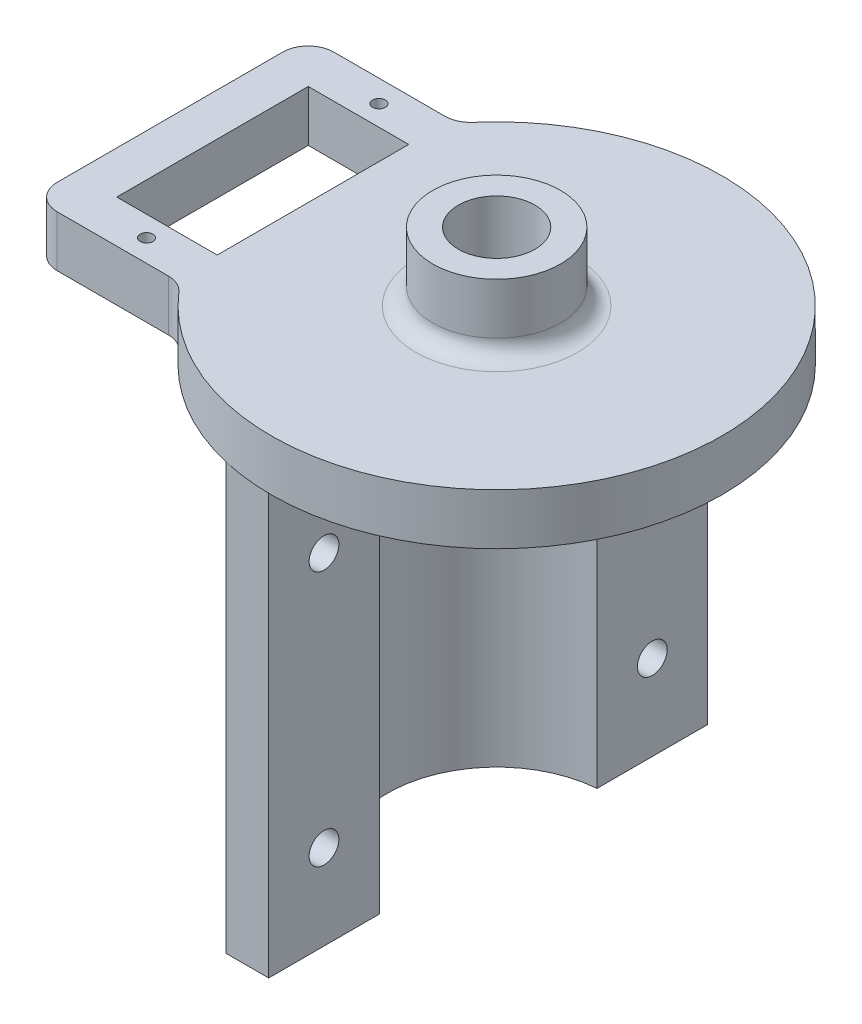
ISO-10303-21;
HEADER;
FILE_DESCRIPTION(('STEP AP214'),'2;1');
FILE_NAME('part.step','',(''),(''),'','','');
FILE_SCHEMA(('AUTOMOTIVE_DESIGN { 1 0 10303 214 1 1 1 1 }'));
ENDSEC;
DATA;
#1=APPLICATION_CONTEXT('core data for automotive mechanical design processes');
#2=APPLICATION_PROTOCOL_DEFINITION('international standard','automotive_design',2000,#1);
#3=PRODUCT_CONTEXT('',#1,'mechanical');
#4=PRODUCT('Part','Part','',(#3));
#5=PRODUCT_RELATED_PRODUCT_CATEGORY('part','',(#4));
#6=PRODUCT_DEFINITION_FORMATION('','',#4);
#7=PRODUCT_DEFINITION_CONTEXT('part definition',#1,'design');
#8=PRODUCT_DEFINITION('design','',#6,#7);
#9=PRODUCT_DEFINITION_SHAPE('','',#8);
#10=(LENGTH_UNIT() NAMED_UNIT(*) SI_UNIT(.MILLI.,.METRE.));
#11=(NAMED_UNIT(*) PLANE_ANGLE_UNIT() SI_UNIT($,.RADIAN.));
#12=(NAMED_UNIT(*) SI_UNIT($,.STERADIAN.) SOLID_ANGLE_UNIT());
#13=UNCERTAINTY_MEASURE_WITH_UNIT(LENGTH_MEASURE(1.E-05),#10,'distance_accuracy_value','');
#14=(GEOMETRIC_REPRESENTATION_CONTEXT(3) GLOBAL_UNCERTAINTY_ASSIGNED_CONTEXT((#13)) GLOBAL_UNIT_ASSIGNED_CONTEXT((#10,
#11,#12)) REPRESENTATION_CONTEXT('',''));
#15=CARTESIAN_POINT('',(0.,0.,0.));
#16=DIRECTION('',(0.,0.,1.));
#17=DIRECTION('',(1.,0.,0.));
#18=AXIS2_PLACEMENT_3D('',#15,#16,#17);
#19=CARTESIAN_POINT('',(-1.,-50.,25.7848331835619));
#20=DIRECTION('',(0.,0.,-1.));
#21=DIRECTION('',(-1.,0.,0.));
#22=AXIS2_PLACEMENT_3D('',#19,#20,#21);
#23=PLANE('',#22);
#24=DIRECTION('',(-1.,0.,0.));
#25=VECTOR('',#24,1.);
#26=CARTESIAN_POINT('',(-1.,0.,25.7848331835619));
#27=LINE('',#26,#25);
#28=CARTESIAN_POINT('',(-1.,0.,25.7848331835619));
#29=VERTEX_POINT('',#28);
#30=CARTESIAN_POINT('',(-6.,0.,25.7848331835619));
#31=VERTEX_POINT('',#30);
#32=EDGE_CURVE('E353',#29,#31,#27,.T.);
#33=ORIENTED_EDGE('',*,*,#32,.T.);
#34=DIRECTION('',(0.,1.,0.));
#35=VECTOR('',#34,1.);
#36=CARTESIAN_POINT('',(-6.,-50.,25.7848331835619));
#37=LINE('',#36,#35);
#38=CARTESIAN_POINT('',(-6.,-50.,25.7848331835619));
#39=VERTEX_POINT('',#38);
#40=EDGE_CURVE('E436',#39,#31,#37,.T.);
#41=ORIENTED_EDGE('',*,*,#40,.F.);
#42=DIRECTION('',(-1.,0.,0.));
#43=VECTOR('',#42,1.);
#44=CARTESIAN_POINT('',(-1.,-50.,25.7848331835619));
#45=LINE('',#44,#43);
#46=CARTESIAN_POINT('',(-1.,-50.,25.7848331835619));
#47=VERTEX_POINT('',#46);
#48=EDGE_CURVE('E354',#47,#39,#45,.T.);
#49=ORIENTED_EDGE('',*,*,#48,.F.);
#50=DIRECTION('',(0.,1.,0.));
#51=VECTOR('',#50,1.);
#52=CARTESIAN_POINT('',(-1.,-50.,25.7848331835619));
#53=LINE('',#52,#51);
#54=EDGE_CURVE('E378',#47,#29,#53,.T.);
#55=ORIENTED_EDGE('',*,*,#54,.T.);
#56=EDGE_LOOP('',(#33,#41,#49,#55));
#57=FACE_BOUND('',#56,.T.);
#58=ADVANCED_FACE('F45',(#57),#23,.F.);
#59=CARTESIAN_POINT('',(-6.,-50.,25.7848331835619));
#60=DIRECTION('',(1.,0.,0.));
#61=DIRECTION('',(0.,0.,-1.));
#62=AXIS2_PLACEMENT_3D('',#59,#60,#61);
#63=PLANE('',#62);
#64=CARTESIAN_POINT('',(-6.,-40.,19.2853936956035));
#65=DIRECTION('',(1.,0.,0.));
#66=DIRECTION('',(0.,0.,-1.));
#67=AXIS2_PLACEMENT_3D('',#64,#65,#66);
#68=CIRCLE('',#67,1.75);
#69=CARTESIAN_POINT('',(-6.,-40.,17.5353936956035));
#70=VERTEX_POINT('',#69);
#71=EDGE_CURVE('E341',#70,#70,#68,.T.);
#72=ORIENTED_EDGE('',*,*,#71,.T.);
#73=EDGE_LOOP('',(#72));
#74=FACE_BOUND('',#73,.T.);
#75=CARTESIAN_POINT('',(-6.,-10.,19.2853936956035));
#76=DIRECTION('',(1.,0.,0.));
#77=DIRECTION('',(0.,0.,-1.));
#78=AXIS2_PLACEMENT_3D('',#75,#76,#77);
#79=CIRCLE('',#78,1.75);
#80=CARTESIAN_POINT('',(-6.,-10.,17.5353936956035));
#81=VERTEX_POINT('',#80);
#82=EDGE_CURVE('E337',#81,#81,#79,.T.);
#83=ORIENTED_EDGE('',*,*,#82,.T.);
#84=EDGE_LOOP('',(#83));
#85=FACE_BOUND('',#84,.T.);
#86=DIRECTION('',(0.,0.,-1.));
#87=VECTOR('',#86,1.);
#88=CARTESIAN_POINT('',(-6.,0.,25.7848331835619));
#89=LINE('',#88,#87);
#90=CARTESIAN_POINT('',(-5.99999999999999,0.,16.7848331835619));
#91=VERTEX_POINT('',#90);
#92=EDGE_CURVE('E382',#31,#91,#89,.T.);
#93=ORIENTED_EDGE('',*,*,#92,.T.);
#94=DIRECTION('',(0.,1.,0.));
#95=VECTOR('',#94,1.);
#96=CARTESIAN_POINT('',(-5.99999999999999,-50.,16.7848331835619));
#97=LINE('',#96,#95);
#98=CARTESIAN_POINT('',(-5.99999999999999,-50.,16.7848331835619));
#99=VERTEX_POINT('',#98);
#100=EDGE_CURVE('E432',#99,#91,#97,.T.);
#101=ORIENTED_EDGE('',*,*,#100,.F.);
#102=DIRECTION('',(0.,0.,-1.));
#103=VECTOR('',#102,1.);
#104=CARTESIAN_POINT('',(-6.,-50.,25.7848331835619));
#105=LINE('',#104,#103);
#106=EDGE_CURVE('E357',#39,#99,#105,.T.);
#107=ORIENTED_EDGE('',*,*,#106,.F.);
#108=ORIENTED_EDGE('',*,*,#40,.T.);
#109=EDGE_LOOP('',(#93,#101,#107,#108));
#110=FACE_BOUND('',#109,.T.);
#111=ADVANCED_FACE('F462',(#74,#85,#110),#63,.F.);
#112=CARTESIAN_POINT('',(0.,-50.,0.));
#113=DIRECTION('',(0.,1.,0.));
#114=DIRECTION('',(0.,0.,1.));
#115=AXIS2_PLACEMENT_3D('',#112,#113,#114);
#116=CYLINDRICAL_SURFACE('',#115,17.825);
#117=CARTESIAN_POINT('',(0.,0.,0.));
#118=DIRECTION('',(0.,-1.,0.));
#119=DIRECTION('',(0.,0.,-1.));
#120=AXIS2_PLACEMENT_3D('',#117,#118,#119);
#121=CIRCLE('',#120,17.825);
#122=CARTESIAN_POINT('',(-6.,0.,-16.7848331835619));
#123=VERTEX_POINT('',#122);
#124=EDGE_CURVE('E386',#91,#123,#121,.T.);
#125=ORIENTED_EDGE('',*,*,#124,.T.);
#126=DIRECTION('',(0.,1.,0.));
#127=VECTOR('',#126,1.);
#128=CARTESIAN_POINT('',(-6.,-50.,-16.7848331835619));
#129=LINE('',#128,#127);
#130=CARTESIAN_POINT('',(-6.,-50.,-16.7848331835619));
#131=VERTEX_POINT('',#130);
#132=EDGE_CURVE('E428',#131,#123,#129,.T.);
#133=ORIENTED_EDGE('',*,*,#132,.F.);
#134=CARTESIAN_POINT('',(0.,-50.,0.));
#135=DIRECTION('',(0.,-1.,0.));
#136=DIRECTION('',(0.,0.,-1.));
#137=AXIS2_PLACEMENT_3D('',#134,#135,#136);
#138=CIRCLE('',#137,17.825);
#139=EDGE_CURVE('E361',#99,#131,#138,.T.);
#140=ORIENTED_EDGE('',*,*,#139,.F.);
#141=ORIENTED_EDGE('',*,*,#100,.T.);
#142=EDGE_LOOP('',(#125,#133,#140,#141));
#143=FACE_BOUND('',#142,.T.);
#144=ADVANCED_FACE('F468',(#143),#116,.T.);
#145=CARTESIAN_POINT('',(-6.,-50.,-16.7848331835619));
#146=DIRECTION('',(1.,0.,0.));
#147=DIRECTION('',(0.,0.,-1.));
#148=AXIS2_PLACEMENT_3D('',#145,#146,#147);
#149=PLANE('',#148);
#150=CARTESIAN_POINT('',(-6.,-10.,-19.2853936956035));
#151=DIRECTION('',(1.,0.,0.));
#152=DIRECTION('',(0.,0.,-1.));
#153=AXIS2_PLACEMENT_3D('',#150,#151,#152);
#154=CIRCLE('',#153,1.75000000000001);
#155=CARTESIAN_POINT('',(-6.,-10.,-21.0353936956035));
#156=VERTEX_POINT('',#155);
#157=EDGE_CURVE('E349',#156,#156,#154,.T.);
#158=ORIENTED_EDGE('',*,*,#157,.T.);
#159=EDGE_LOOP('',(#158));
#160=FACE_BOUND('',#159,.T.);
#161=CARTESIAN_POINT('',(-6.,-40.,-19.2853936956035));
#162=DIRECTION('',(1.,0.,0.));
#163=DIRECTION('',(0.,0.,-1.));
#164=AXIS2_PLACEMENT_3D('',#161,#162,#163);
#165=CIRCLE('',#164,1.75000000000001);
#166=CARTESIAN_POINT('',(-6.,-40.,-21.0353936956036));
#167=VERTEX_POINT('',#166);
#168=EDGE_CURVE('E345',#167,#167,#165,.T.);
#169=ORIENTED_EDGE('',*,*,#168,.T.);
#170=EDGE_LOOP('',(#169));
#171=FACE_BOUND('',#170,.T.);
#172=DIRECTION('',(0.,0.,-1.));
#173=VECTOR('',#172,1.);
#174=CARTESIAN_POINT('',(-6.,0.,-16.7848331835619));
#175=LINE('',#174,#173);
#176=CARTESIAN_POINT('',(-6.,0.,-25.7848331835619));
#177=VERTEX_POINT('',#176);
#178=EDGE_CURVE('E390',#123,#177,#175,.T.);
#179=ORIENTED_EDGE('',*,*,#178,.T.);
#180=DIRECTION('',(0.,1.,0.));
#181=VECTOR('',#180,1.);
#182=CARTESIAN_POINT('',(-6.,-50.,-25.7848331835619));
#183=LINE('',#182,#181);
#184=CARTESIAN_POINT('',(-6.,-50.,-25.7848331835619));
#185=VERTEX_POINT('',#184);
#186=EDGE_CURVE('E424',#185,#177,#183,.T.);
#187=ORIENTED_EDGE('',*,*,#186,.F.);
#188=DIRECTION('',(0.,0.,-1.));
#189=VECTOR('',#188,1.);
#190=CARTESIAN_POINT('',(-6.,-50.,-16.7848331835619));
#191=LINE('',#190,#189);
#192=EDGE_CURVE('E364',#131,#185,#191,.T.);
#193=ORIENTED_EDGE('',*,*,#192,.F.);
#194=ORIENTED_EDGE('',*,*,#132,.T.);
#195=EDGE_LOOP('',(#179,#187,#193,#194));
#196=FACE_BOUND('',#195,.T.);
#197=ADVANCED_FACE('F474',(#160,#171,#196),#149,.F.);
#198=CARTESIAN_POINT('',(-6.,-50.,-25.7848331835619));
#199=DIRECTION('',(0.,0.,1.));
#200=DIRECTION('',(1.,0.,0.));
#201=AXIS2_PLACEMENT_3D('',#198,#199,#200);
#202=PLANE('',#201);
#203=DIRECTION('',(1.,0.,0.));
#204=VECTOR('',#203,1.);
#205=CARTESIAN_POINT('',(-6.,0.,-25.7848331835619));
#206=LINE('',#205,#204);
#207=CARTESIAN_POINT('',(-1.,0.,-25.7848331835619));
#208=VERTEX_POINT('',#207);
#209=EDGE_CURVE('E394',#177,#208,#206,.T.);
#210=ORIENTED_EDGE('',*,*,#209,.T.);
#211=DIRECTION('',(0.,1.,0.));
#212=VECTOR('',#211,1.);
#213=CARTESIAN_POINT('',(-1.,-50.,-25.7848331835619));
#214=LINE('',#213,#212);
#215=CARTESIAN_POINT('',(-1.,-50.,-25.7848331835619));
#216=VERTEX_POINT('',#215);
#217=EDGE_CURVE('E420',#216,#208,#214,.T.);
#218=ORIENTED_EDGE('',*,*,#217,.F.);
#219=DIRECTION('',(1.,0.,0.));
#220=VECTOR('',#219,1.);
#221=CARTESIAN_POINT('',(-6.,-50.,-25.7848331835619));
#222=LINE('',#221,#220);
#223=EDGE_CURVE('E367',#185,#216,#222,.T.);
#224=ORIENTED_EDGE('',*,*,#223,.F.);
#225=ORIENTED_EDGE('',*,*,#186,.T.);
#226=EDGE_LOOP('',(#210,#218,#224,#225));
#227=FACE_BOUND('',#226,.T.);
#228=ADVANCED_FACE('F478',(#227),#202,.F.);
#229=CARTESIAN_POINT('',(-1.,-50.,-25.7848331835619));
#230=DIRECTION('',(-1.,0.,0.));
#231=DIRECTION('',(0.,0.,1.));
#232=AXIS2_PLACEMENT_3D('',#229,#230,#231);
#233=PLANE('',#232);
#234=CARTESIAN_POINT('',(-1.,-10.,-19.2853936956035));
#235=DIRECTION('',(1.,0.,0.));
#236=DIRECTION('',(0.,0.,1.));
#237=AXIS2_PLACEMENT_3D('',#234,#235,#236);
#238=CIRCLE('',#237,1.75000000000001);
#239=CARTESIAN_POINT('',(-1.,-10.,-17.5353936956035));
#240=VERTEX_POINT('',#239);
#241=EDGE_CURVE('E321',#240,#240,#238,.T.);
#242=ORIENTED_EDGE('',*,*,#241,.F.);
#243=EDGE_LOOP('',(#242));
#244=FACE_BOUND('',#243,.T.);
#245=CARTESIAN_POINT('',(-1.,-40.,-19.2853936956035));
#246=DIRECTION('',(1.,0.,0.));
#247=DIRECTION('',(0.,0.,-1.));
#248=AXIS2_PLACEMENT_3D('',#245,#246,#247);
#249=CIRCLE('',#248,1.75000000000001);
#250=CARTESIAN_POINT('',(-1.,-40.,-21.0353936956036));
#251=VERTEX_POINT('',#250);
#252=EDGE_CURVE('E327',#251,#251,#249,.T.);
#253=ORIENTED_EDGE('',*,*,#252,.F.);
#254=EDGE_LOOP('',(#253));
#255=FACE_BOUND('',#254,.T.);
#256=DIRECTION('',(0.,0.,1.));
#257=VECTOR('',#256,1.);
#258=CARTESIAN_POINT('',(-1.,0.,-25.7848331835619));
#259=LINE('',#258,#257);
#260=CARTESIAN_POINT('',(-1.00000000000001,0.,-12.7859542076452));
#261=VERTEX_POINT('',#260);
#262=EDGE_CURVE('E398',#208,#261,#259,.T.);
#263=ORIENTED_EDGE('',*,*,#262,.T.);
#264=DIRECTION('',(0.,1.,0.));
#265=VECTOR('',#264,1.);
#266=CARTESIAN_POINT('',(-1.00000000000001,-50.,-12.7859542076452));
#267=LINE('',#266,#265);
#268=CARTESIAN_POINT('',(-1.00000000000001,-50.,-12.7859542076452));
#269=VERTEX_POINT('',#268);
#270=EDGE_CURVE('E416',#269,#261,#267,.T.);
#271=ORIENTED_EDGE('',*,*,#270,.F.);
#272=DIRECTION('',(0.,0.,1.));
#273=VECTOR('',#272,1.);
#274=CARTESIAN_POINT('',(-1.,-50.,-25.7848331835619));
#275=LINE('',#274,#273);
#276=EDGE_CURVE('E370',#216,#269,#275,.T.);
#277=ORIENTED_EDGE('',*,*,#276,.F.);
#278=ORIENTED_EDGE('',*,*,#217,.T.);
#279=EDGE_LOOP('',(#263,#271,#277,#278));
#280=FACE_BOUND('',#279,.T.);
#281=ADVANCED_FACE('F482',(#244,#255,#280),#233,.F.);
#282=CARTESIAN_POINT('',(0.,-50.,0.));
#283=DIRECTION('',(0.,1.,0.));
#284=DIRECTION('',(0.,0.,1.));
#285=AXIS2_PLACEMENT_3D('',#282,#283,#284);
#286=CYLINDRICAL_SURFACE('',#285,12.825);
#287=CARTESIAN_POINT('',(0.,0.,0.));
#288=DIRECTION('',(0.,1.,0.));
#289=DIRECTION('',(0.,0.,-1.));
#290=AXIS2_PLACEMENT_3D('',#287,#288,#289);
#291=CIRCLE('',#290,12.825);
#292=CARTESIAN_POINT('',(-1.,0.,12.7859542076452));
#293=VERTEX_POINT('',#292);
#294=EDGE_CURVE('E402',#261,#293,#291,.T.);
#295=ORIENTED_EDGE('',*,*,#294,.T.);
#296=DIRECTION('',(0.,1.,0.));
#297=VECTOR('',#296,1.);
#298=CARTESIAN_POINT('',(-1.,-50.,12.7859542076452));
#299=LINE('',#298,#297);
#300=CARTESIAN_POINT('',(-1.,-50.,12.7859542076452));
#301=VERTEX_POINT('',#300);
#302=EDGE_CURVE('E412',#301,#293,#299,.T.);
#303=ORIENTED_EDGE('',*,*,#302,.F.);
#304=CARTESIAN_POINT('',(0.,-50.,0.));
#305=DIRECTION('',(0.,1.,0.));
#306=DIRECTION('',(0.,0.,-1.));
#307=AXIS2_PLACEMENT_3D('',#304,#305,#306);
#308=CIRCLE('',#307,12.825);
#309=EDGE_CURVE('E373',#269,#301,#308,.T.);
#310=ORIENTED_EDGE('',*,*,#309,.F.);
#311=ORIENTED_EDGE('',*,*,#270,.T.);
#312=EDGE_LOOP('',(#295,#303,#310,#311));
#313=FACE_BOUND('',#312,.T.);
#314=ADVANCED_FACE('F486',(#313),#286,.F.);
#315=CARTESIAN_POINT('',(-1.,-50.,25.7848331835619));
#316=DIRECTION('',(-1.,0.,0.));
#317=DIRECTION('',(0.,0.,1.));
#318=AXIS2_PLACEMENT_3D('',#315,#316,#317);
#319=PLANE('',#318);
#320=CARTESIAN_POINT('',(-1.,-40.,19.2853936956035));
#321=DIRECTION('',(1.,0.,0.));
#322=DIRECTION('',(0.,0.,1.));
#323=AXIS2_PLACEMENT_3D('',#320,#321,#322);
#324=CIRCLE('',#323,1.75);
#325=CARTESIAN_POINT('',(-1.,-40.,21.0353936956035));
#326=VERTEX_POINT('',#325);
#327=EDGE_CURVE('E322',#326,#326,#324,.T.);
#328=ORIENTED_EDGE('',*,*,#327,.F.);
#329=EDGE_LOOP('',(#328));
#330=FACE_BOUND('',#329,.T.);
#331=CARTESIAN_POINT('',(-1.,-10.,19.2853936956035));
#332=DIRECTION('',(1.,0.,0.));
#333=DIRECTION('',(0.,0.,-1.));
#334=AXIS2_PLACEMENT_3D('',#331,#332,#333);
#335=CIRCLE('',#334,1.75);
#336=CARTESIAN_POINT('',(-1.,-10.,17.5353936956035));
#337=VERTEX_POINT('',#336);
#338=EDGE_CURVE('E326',#337,#337,#335,.T.);
#339=ORIENTED_EDGE('',*,*,#338,.F.);
#340=EDGE_LOOP('',(#339));
#341=FACE_BOUND('',#340,.T.);
#342=DIRECTION('',(0.,0.,1.));
#343=VECTOR('',#342,1.);
#344=CARTESIAN_POINT('',(-1.,0.,25.7848331835619));
#345=LINE('',#344,#343);
#346=EDGE_CURVE('E358',#293,#29,#345,.T.);
#347=ORIENTED_EDGE('',*,*,#346,.T.);
#348=ORIENTED_EDGE('',*,*,#54,.F.);
#349=DIRECTION('',(0.,0.,1.));
#350=VECTOR('',#349,1.);
#351=CARTESIAN_POINT('',(-1.,-50.,25.7848331835619));
#352=LINE('',#351,#350);
#353=EDGE_CURVE('E62',#301,#47,#352,.T.);
#354=ORIENTED_EDGE('',*,*,#353,.F.);
#355=ORIENTED_EDGE('',*,*,#302,.T.);
#356=EDGE_LOOP('',(#347,#348,#354,#355));
#357=FACE_BOUND('',#356,.T.);
#358=ADVANCED_FACE('F490',(#330,#341,#357),#319,.F.);
#359=CARTESIAN_POINT('',(0.,-50.,0.));
#360=DIRECTION('',(0.,-1.,0.));
#361=DIRECTION('',(0.,0.,-1.));
#362=AXIS2_PLACEMENT_3D('',#359,#360,#361);
#363=PLANE('',#362);
#364=ORIENTED_EDGE('',*,*,#48,.T.);
#365=ORIENTED_EDGE('',*,*,#106,.T.);
#366=ORIENTED_EDGE('',*,*,#139,.T.);
#367=ORIENTED_EDGE('',*,*,#192,.T.);
#368=ORIENTED_EDGE('',*,*,#223,.T.);
#369=ORIENTED_EDGE('',*,*,#276,.T.);
#370=ORIENTED_EDGE('',*,*,#309,.T.);
#371=ORIENTED_EDGE('',*,*,#353,.T.);
#372=EDGE_LOOP('',(#364,#365,#366,#367,#368,#369,#370,#371));
#373=FACE_BOUND('',#372,.T.);
#374=ADVANCED_FACE('F494',(#373),#363,.T.);
#375=CARTESIAN_POINT('',(-17.825,-10.,19.2853936956035));
#376=DIRECTION('',(1.,0.,0.));
#377=DIRECTION('',(0.,0.,-1.));
#378=AXIS2_PLACEMENT_3D('',#375,#376,#377);
#379=CYLINDRICAL_SURFACE('',#378,1.75);
#380=ORIENTED_EDGE('',*,*,#338,.T.);
#381=EDGE_LOOP('',(#380));
#382=FACE_BOUND('',#381,.T.);
#383=ORIENTED_EDGE('',*,*,#82,.F.);
#384=EDGE_LOOP('',(#383));
#385=FACE_BOUND('',#384,.T.);
#386=ADVANCED_FACE('F498',(#382,#385),#379,.F.);
#387=CARTESIAN_POINT('',(-17.825,-40.,19.2853936956035));
#388=DIRECTION('',(1.,0.,0.));
#389=DIRECTION('',(0.,0.,-1.));
#390=AXIS2_PLACEMENT_3D('',#387,#388,#389);
#391=CYLINDRICAL_SURFACE('',#390,1.75);
#392=ORIENTED_EDGE('',*,*,#327,.T.);
#393=EDGE_LOOP('',(#392));
#394=FACE_BOUND('',#393,.T.);
#395=ORIENTED_EDGE('',*,*,#71,.F.);
#396=EDGE_LOOP('',(#395));
#397=FACE_BOUND('',#396,.T.);
#398=ADVANCED_FACE('F501',(#394,#397),#391,.F.);
#399=CARTESIAN_POINT('',(-17.825,-40.,-19.2853936956035));
#400=DIRECTION('',(1.,0.,0.));
#401=DIRECTION('',(0.,0.,-1.));
#402=AXIS2_PLACEMENT_3D('',#399,#400,#401);
#403=CYLINDRICAL_SURFACE('',#402,1.75000000000001);
#404=ORIENTED_EDGE('',*,*,#252,.T.);
#405=EDGE_LOOP('',(#404));
#406=FACE_BOUND('',#405,.T.);
#407=ORIENTED_EDGE('',*,*,#168,.F.);
#408=EDGE_LOOP('',(#407));
#409=FACE_BOUND('',#408,.T.);
#410=ADVANCED_FACE('F506',(#406,#409),#403,.F.);
#411=CARTESIAN_POINT('',(-17.825,-10.,-19.2853936956035));
#412=DIRECTION('',(1.,0.,0.));
#413=DIRECTION('',(0.,0.,-1.));
#414=AXIS2_PLACEMENT_3D('',#411,#412,#413);
#415=CYLINDRICAL_SURFACE('',#414,1.75000000000001);
#416=ORIENTED_EDGE('',*,*,#241,.T.);
#417=EDGE_LOOP('',(#416));
#418=FACE_BOUND('',#417,.T.);
#419=ORIENTED_EDGE('',*,*,#157,.F.);
#420=EDGE_LOOP('',(#419));
#421=FACE_BOUND('',#420,.T.);
#422=ADVANCED_FACE('F503',(#418,#421),#415,.F.);
#423=CARTESIAN_POINT('',(-22.3189922807748,0.,-19.25));
#424=DIRECTION('',(0.,1.,0.));
#425=DIRECTION('',(0.,0.,1.));
#426=AXIS2_PLACEMENT_3D('',#423,#424,#425);
#427=PLANE('',#426);
#428=CARTESIAN_POINT('',(0.,0.,0.));
#429=DIRECTION('',(0.,1.,0.));
#430=DIRECTION('',(0.,0.,1.));
#431=AXIS2_PLACEMENT_3D('',#428,#429,#430);
#432=CIRCLE('',#431,4.5);
#433=CARTESIAN_POINT('',(0.,0.,4.5));
#434=VERTEX_POINT('',#433);
#435=EDGE_CURVE('E848',#434,#434,#432,.T.);
#436=ORIENTED_EDGE('',*,*,#435,.T.);
#437=EDGE_LOOP('',(#436));
#438=FACE_BOUND('',#437,.T.);
#439=ORIENTED_EDGE('',*,*,#32,.F.);
#440=ORIENTED_EDGE('',*,*,#346,.F.);
#441=ORIENTED_EDGE('',*,*,#294,.F.);
#442=ORIENTED_EDGE('',*,*,#262,.F.);
#443=ORIENTED_EDGE('',*,*,#209,.F.);
#444=CARTESIAN_POINT('',(0.,0.,0.));
#445=DIRECTION('',(0.,1.,0.));
#446=DIRECTION('',(0.,0.,1.));
#447=AXIS2_PLACEMENT_3D('',#444,#445,#446);
#448=CIRCLE('',#447,26.4737156875289);
#449=EDGE_CURVE('E289',#31,#177,#448,.T.);
#450=ORIENTED_EDGE('',*,*,#449,.F.);
#451=EDGE_LOOP('',(#439,#440,#441,#442,#443,#450));
#452=FACE_BOUND('',#451,.T.);
#453=ADVANCED_FACE('F505',(#438,#452),#427,.F.);
#454=CARTESIAN_POINT('',(-27.4841317854503,0.,13.65));
#455=DIRECTION('',(0.,1.,0.));
#456=DIRECTION('',(0.,0.,1.));
#457=AXIS2_PLACEMENT_3D('',#454,#455,#456);
#458=CIRCLE('',#457,0.749999999999998);
#459=CARTESIAN_POINT('',(-27.4841317854503,0.,14.4));
#460=VERTEX_POINT('',#459);
#461=EDGE_CURVE('E777',#460,#460,#458,.T.);
#462=ORIENTED_EDGE('',*,*,#461,.T.);
#463=EDGE_LOOP('',(#462));
#464=FACE_BOUND('',#463,.T.);
#465=CARTESIAN_POINT('',(-27.4841317854503,0.,-13.65));
#466=DIRECTION('',(0.,1.,0.));
#467=DIRECTION('',(0.,0.,1.));
#468=AXIS2_PLACEMENT_3D('',#465,#466,#467);
#469=CIRCLE('',#468,0.749999999999998);
#470=CARTESIAN_POINT('',(-27.4841317854503,0.,-12.9));
#471=VERTEX_POINT('',#470);
#472=EDGE_CURVE('E781',#471,#471,#469,.T.);
#473=ORIENTED_EDGE('',*,*,#472,.T.);
#474=EDGE_LOOP('',(#473));
#475=FACE_BOUND('',#474,.T.);
#476=DIRECTION('',(0.,0.,1.));
#477=VECTOR('',#476,1.);
#478=CARTESIAN_POINT('',(-33.3841317854503,0.,11.25));
#479=LINE('',#478,#477);
#480=CARTESIAN_POINT('',(-33.3841317854503,0.,-11.25));
#481=VERTEX_POINT('',#480);
#482=CARTESIAN_POINT('',(-33.3841317854503,0.,11.25));
#483=VERTEX_POINT('',#482);
#484=EDGE_CURVE('E217',#481,#483,#479,.T.);
#485=ORIENTED_EDGE('',*,*,#484,.T.);
#486=DIRECTION('',(1.,0.,0.));
#487=VECTOR('',#486,1.);
#488=CARTESIAN_POINT('',(-33.3841317854503,0.,11.25));
#489=LINE('',#488,#487);
#490=CARTESIAN_POINT('',(-21.5841317854503,0.,11.25));
#491=VERTEX_POINT('',#490);
#492=EDGE_CURVE('E198',#483,#491,#489,.T.);
#493=ORIENTED_EDGE('',*,*,#492,.T.);
#494=DIRECTION('',(0.,0.,-1.));
#495=VECTOR('',#494,1.);
#496=CARTESIAN_POINT('',(-21.5841317854503,0.,11.25));
#497=LINE('',#496,#495);
#498=CARTESIAN_POINT('',(-21.5841317854503,0.,-11.25));
#499=VERTEX_POINT('',#498);
#500=EDGE_CURVE('E223',#491,#499,#497,.T.);
#501=ORIENTED_EDGE('',*,*,#500,.T.);
#502=DIRECTION('',(-1.,0.,0.));
#503=VECTOR('',#502,1.);
#504=CARTESIAN_POINT('',(-33.3841317854503,0.,-11.25));
#505=LINE('',#504,#503);
#506=EDGE_CURVE('E192',#499,#481,#505,.T.);
#507=ORIENTED_EDGE('',*,*,#506,.T.);
#508=EDGE_LOOP('',(#485,#493,#501,#507));
#509=FACE_BOUND('',#508,.T.);
#510=ORIENTED_EDGE('',*,*,#178,.F.);
#511=ORIENTED_EDGE('',*,*,#124,.F.);
#512=ORIENTED_EDGE('',*,*,#92,.F.);
#513=CARTESIAN_POINT('',(-20.0472401355014,0.,17.290627092551));
#514=VERTEX_POINT('',#513);
#515=EDGE_CURVE('E242',#514,#31,#448,.T.);
#516=ORIENTED_EDGE('',*,*,#515,.F.);
#517=CARTESIAN_POINT('',(-22.3189922807748,0.,19.25));
#518=DIRECTION('',(0.,-1.,0.));
#519=DIRECTION('',(0.,0.,-1.));
#520=AXIS2_PLACEMENT_3D('',#517,#518,#519);
#521=CIRCLE('',#520,3.);
#522=CARTESIAN_POINT('',(-22.3189922807748,0.,16.25));
#523=VERTEX_POINT('',#522);
#524=EDGE_CURVE('E282',#523,#514,#521,.T.);
#525=ORIENTED_EDGE('',*,*,#524,.F.);
#526=DIRECTION('',(1.,0.,0.));
#527=VECTOR('',#526,1.);
#528=CARTESIAN_POINT('',(-35.3841317854503,0.,16.25));
#529=LINE('',#528,#527);
#530=CARTESIAN_POINT('',(-35.3841317854503,0.,16.25));
#531=VERTEX_POINT('',#530);
#532=EDGE_CURVE('E279',#531,#523,#529,.T.);
#533=ORIENTED_EDGE('',*,*,#532,.F.);
#534=CARTESIAN_POINT('',(-35.3841317854503,0.,13.25));
#535=DIRECTION('',(0.,1.,0.));
#536=DIRECTION('',(0.,0.,-1.));
#537=AXIS2_PLACEMENT_3D('',#534,#535,#536);
#538=CIRCLE('',#537,3.);
#539=CARTESIAN_POINT('',(-38.3841317854503,0.,13.25));
#540=VERTEX_POINT('',#539);
#541=EDGE_CURVE('E276',#540,#531,#538,.T.);
#542=ORIENTED_EDGE('',*,*,#541,.F.);
#543=DIRECTION('',(0.,0.,1.));
#544=VECTOR('',#543,1.);
#545=CARTESIAN_POINT('',(-38.3841317854503,0.,13.25));
#546=LINE('',#545,#544);
#547=CARTESIAN_POINT('',(-38.3841317854503,0.,-13.25));
#548=VERTEX_POINT('',#547);
#549=EDGE_CURVE('E273',#548,#540,#546,.T.);
#550=ORIENTED_EDGE('',*,*,#549,.F.);
#551=CARTESIAN_POINT('',(-35.3841317854503,0.,-13.25));
#552=DIRECTION('',(0.,1.,0.));
#553=DIRECTION('',(0.,0.,-1.));
#554=AXIS2_PLACEMENT_3D('',#551,#552,#553);
#555=CIRCLE('',#554,3.);
#556=CARTESIAN_POINT('',(-35.3841317854503,0.,-16.25));
#557=VERTEX_POINT('',#556);
#558=EDGE_CURVE('E270',#557,#548,#555,.T.);
#559=ORIENTED_EDGE('',*,*,#558,.F.);
#560=DIRECTION('',(-1.,0.,0.));
#561=VECTOR('',#560,1.);
#562=CARTESIAN_POINT('',(-35.3841317854503,0.,-16.25));
#563=LINE('',#562,#561);
#564=CARTESIAN_POINT('',(-22.3189922807748,0.,-16.25));
#565=VERTEX_POINT('',#564);
#566=EDGE_CURVE('E267',#565,#557,#563,.T.);
#567=ORIENTED_EDGE('',*,*,#566,.F.);
#568=CARTESIAN_POINT('',(-22.3189922807748,0.,-19.25));
#569=DIRECTION('',(0.,-1.,0.));
#570=DIRECTION('',(0.,0.,1.));
#571=AXIS2_PLACEMENT_3D('',#568,#569,#570);
#572=CIRCLE('',#571,3.);
#573=CARTESIAN_POINT('',(-20.0472401355014,0.,-17.290627092551));
#574=VERTEX_POINT('',#573);
#575=EDGE_CURVE('E200',#574,#565,#572,.T.);
#576=ORIENTED_EDGE('',*,*,#575,.F.);
#577=EDGE_CURVE('E285',#177,#574,#448,.T.);
#578=ORIENTED_EDGE('',*,*,#577,.F.);
#579=EDGE_LOOP('',(#510,#511,#512,#516,#525,#533,#542,#550,#559,#567,#576,#578));
#580=FACE_BOUND('',#579,.T.);
#581=ADVANCED_FACE('F547',(#464,#475,#509,#580),#427,.F.);
#582=CARTESIAN_POINT('',(-22.3189922807748,6.,-19.25));
#583=DIRECTION('',(0.,1.,0.));
#584=DIRECTION('',(0.,0.,1.));
#585=AXIS2_PLACEMENT_3D('',#582,#583,#584);
#586=PLANE('',#585);
#587=CARTESIAN_POINT('',(0.,6.,0.));
#588=DIRECTION('',(0.,1.,0.));
#589=DIRECTION('',(0.,0.,1.));
#590=AXIS2_PLACEMENT_3D('',#587,#588,#589);
#591=CIRCLE('',#590,9.5);
#592=CARTESIAN_POINT('',(0.,6.,9.5));
#593=VERTEX_POINT('',#592);
#594=EDGE_CURVE('E11',#593,#593,#591,.F.);
#595=ORIENTED_EDGE('',*,*,#594,.T.);
#596=EDGE_LOOP('',(#595));
#597=FACE_BOUND('',#596,.T.);
#598=CARTESIAN_POINT('',(-27.4841317854503,6.,-13.65));
#599=DIRECTION('',(0.,1.,0.));
#600=DIRECTION('',(0.,0.,1.));
#601=AXIS2_PLACEMENT_3D('',#598,#599,#600);
#602=CIRCLE('',#601,0.749999999999998);
#603=CARTESIAN_POINT('',(-27.4841317854503,6.,-12.9));
#604=VERTEX_POINT('',#603);
#605=EDGE_CURVE('E220',#604,#604,#602,.T.);
#606=ORIENTED_EDGE('',*,*,#605,.F.);
#607=EDGE_LOOP('',(#606));
#608=FACE_BOUND('',#607,.T.);
#609=CARTESIAN_POINT('',(-22.3189922807748,6.,-19.25));
#610=DIRECTION('',(0.,-1.,0.));
#611=DIRECTION('',(0.,0.,1.));
#612=AXIS2_PLACEMENT_3D('',#609,#610,#611);
#613=CIRCLE('',#612,3.);
#614=CARTESIAN_POINT('',(-20.0472401355014,6.,-17.290627092551));
#615=VERTEX_POINT('',#614);
#616=CARTESIAN_POINT('',(-22.3189922807748,6.,-16.25));
#617=VERTEX_POINT('',#616);
#618=EDGE_CURVE('E237',#615,#617,#613,.T.);
#619=ORIENTED_EDGE('',*,*,#618,.T.);
#620=DIRECTION('',(-1.,0.,0.));
#621=VECTOR('',#620,1.);
#622=CARTESIAN_POINT('',(-35.3841317854503,6.,-16.25));
#623=LINE('',#622,#621);
#624=CARTESIAN_POINT('',(-35.3841317854503,6.,-16.25));
#625=VERTEX_POINT('',#624);
#626=EDGE_CURVE('E241',#617,#625,#623,.T.);
#627=ORIENTED_EDGE('',*,*,#626,.T.);
#628=CARTESIAN_POINT('',(-35.3841317854503,6.,-13.25));
#629=DIRECTION('',(0.,1.,0.));
#630=DIRECTION('',(0.,0.,-1.));
#631=AXIS2_PLACEMENT_3D('',#628,#629,#630);
#632=CIRCLE('',#631,3.);
#633=CARTESIAN_POINT('',(-38.3841317854503,6.,-13.25));
#634=VERTEX_POINT('',#633);
#635=EDGE_CURVE('E245',#625,#634,#632,.T.);
#636=ORIENTED_EDGE('',*,*,#635,.T.);
#637=DIRECTION('',(0.,0.,1.));
#638=VECTOR('',#637,1.);
#639=CARTESIAN_POINT('',(-38.3841317854503,6.,13.25));
#640=LINE('',#639,#638);
#641=CARTESIAN_POINT('',(-38.3841317854503,6.,13.25));
#642=VERTEX_POINT('',#641);
#643=EDGE_CURVE('E248',#634,#642,#640,.T.);
#644=ORIENTED_EDGE('',*,*,#643,.T.);
#645=CARTESIAN_POINT('',(-35.3841317854503,6.,13.25));
#646=DIRECTION('',(0.,1.,0.));
#647=DIRECTION('',(0.,0.,-1.));
#648=AXIS2_PLACEMENT_3D('',#645,#646,#647);
#649=CIRCLE('',#648,3.);
#650=CARTESIAN_POINT('',(-35.3841317854503,6.,16.25));
#651=VERTEX_POINT('',#650);
#652=EDGE_CURVE('E251',#642,#651,#649,.T.);
#653=ORIENTED_EDGE('',*,*,#652,.T.);
#654=DIRECTION('',(1.,0.,0.));
#655=VECTOR('',#654,1.);
#656=CARTESIAN_POINT('',(-35.3841317854503,6.,16.25));
#657=LINE('',#656,#655);
#658=CARTESIAN_POINT('',(-22.3189922807748,6.,16.25));
#659=VERTEX_POINT('',#658);
#660=EDGE_CURVE('E254',#651,#659,#657,.T.);
#661=ORIENTED_EDGE('',*,*,#660,.T.);
#662=CARTESIAN_POINT('',(-22.3189922807748,6.,19.25));
#663=DIRECTION('',(0.,-1.,0.));
#664=DIRECTION('',(0.,0.,-1.));
#665=AXIS2_PLACEMENT_3D('',#662,#663,#664);
#666=CIRCLE('',#665,3.);
#667=CARTESIAN_POINT('',(-20.0472401355014,6.,17.290627092551));
#668=VERTEX_POINT('',#667);
#669=EDGE_CURVE('E257',#659,#668,#666,.T.);
#670=ORIENTED_EDGE('',*,*,#669,.T.);
#671=CARTESIAN_POINT('',(0.,6.,0.));
#672=DIRECTION('',(0.,1.,0.));
#673=DIRECTION('',(0.,0.,1.));
#674=AXIS2_PLACEMENT_3D('',#671,#672,#673);
#675=CIRCLE('',#674,26.4737156875289);
#676=EDGE_CURVE('E260',#668,#615,#675,.T.);
#677=ORIENTED_EDGE('',*,*,#676,.T.);
#678=EDGE_LOOP('',(#619,#627,#636,#644,#653,#661,#670,#677));
#679=FACE_BOUND('',#678,.T.);
#680=DIRECTION('',(1.,0.,0.));
#681=VECTOR('',#680,1.);
#682=CARTESIAN_POINT('',(-33.3841317854503,6.,11.25));
#683=LINE('',#682,#681);
#684=CARTESIAN_POINT('',(-33.3841317854503,6.,11.25));
#685=VERTEX_POINT('',#684);
#686=CARTESIAN_POINT('',(-21.5841317854503,6.,11.25));
#687=VERTEX_POINT('',#686);
#688=EDGE_CURVE('E191',#685,#687,#683,.T.);
#689=ORIENTED_EDGE('',*,*,#688,.F.);
#690=DIRECTION('',(0.,0.,1.));
#691=VECTOR('',#690,1.);
#692=CARTESIAN_POINT('',(-33.3841317854503,6.,11.25));
#693=LINE('',#692,#691);
#694=CARTESIAN_POINT('',(-33.3841317854503,6.,-11.25));
#695=VERTEX_POINT('',#694);
#696=EDGE_CURVE('E180',#695,#685,#693,.T.);
#697=ORIENTED_EDGE('',*,*,#696,.F.);
#698=DIRECTION('',(-1.,0.,0.));
#699=VECTOR('',#698,1.);
#700=CARTESIAN_POINT('',(-33.3841317854503,6.,-11.25));
#701=LINE('',#700,#699);
#702=CARTESIAN_POINT('',(-21.5841317854503,6.,-11.25));
#703=VERTEX_POINT('',#702);
#704=EDGE_CURVE('E211',#703,#695,#701,.T.);
#705=ORIENTED_EDGE('',*,*,#704,.F.);
#706=DIRECTION('',(0.,0.,-1.));
#707=VECTOR('',#706,1.);
#708=CARTESIAN_POINT('',(-21.5841317854503,6.,11.25));
#709=LINE('',#708,#707);
#710=EDGE_CURVE('E207',#687,#703,#709,.T.);
#711=ORIENTED_EDGE('',*,*,#710,.F.);
#712=EDGE_LOOP('',(#689,#697,#705,#711));
#713=FACE_BOUND('',#712,.T.);
#714=CARTESIAN_POINT('',(-27.4841317854503,6.,13.65));
#715=DIRECTION('',(0.,1.,0.));
#716=DIRECTION('',(0.,0.,1.));
#717=AXIS2_PLACEMENT_3D('',#714,#715,#716);
#718=CIRCLE('',#717,0.749999999999998);
#719=CARTESIAN_POINT('',(-27.4841317854503,6.,14.4));
#720=VERTEX_POINT('',#719);
#721=EDGE_CURVE('E834',#720,#720,#718,.T.);
#722=ORIENTED_EDGE('',*,*,#721,.F.);
#723=EDGE_LOOP('',(#722));
#724=FACE_BOUND('',#723,.T.);
#725=ADVANCED_FACE('F204',(#597,#608,#679,#713,#724),#586,.T.);
#726=CARTESIAN_POINT('',(-22.3189922807748,6.,-19.25));
#727=DIRECTION('',(0.,-1.,0.));
#728=DIRECTION('',(0.,0.,-1.));
#729=AXIS2_PLACEMENT_3D('',#726,#727,#728);
#730=CYLINDRICAL_SURFACE('',#729,3.);
#731=ORIENTED_EDGE('',*,*,#575,.T.);
#732=DIRECTION('',(0.,-1.,0.));
#733=VECTOR('',#732,1.);
#734=CARTESIAN_POINT('',(-22.3189922807748,6.,-16.25));
#735=LINE('',#734,#733);
#736=EDGE_CURVE('E317',#617,#565,#735,.T.);
#737=ORIENTED_EDGE('',*,*,#736,.F.);
#738=ORIENTED_EDGE('',*,*,#618,.F.);
#739=DIRECTION('',(0.,-1.,0.));
#740=VECTOR('',#739,1.);
#741=CARTESIAN_POINT('',(-20.0472401355014,6.,-17.290627092551));
#742=LINE('',#741,#740);
#743=EDGE_CURVE('E263',#615,#574,#742,.T.);
#744=ORIENTED_EDGE('',*,*,#743,.T.);
#745=EDGE_LOOP('',(#731,#737,#738,#744));
#746=FACE_BOUND('',#745,.T.);
#747=ADVANCED_FACE('F514',(#746),#730,.F.);
#748=CARTESIAN_POINT('',(-35.3841317854503,6.,-16.25));
#749=DIRECTION('',(0.,0.,1.));
#750=DIRECTION('',(1.,0.,0.));
#751=AXIS2_PLACEMENT_3D('',#748,#749,#750);
#752=PLANE('',#751);
#753=ORIENTED_EDGE('',*,*,#566,.T.);
#754=DIRECTION('',(0.,-1.,0.));
#755=VECTOR('',#754,1.);
#756=CARTESIAN_POINT('',(-35.3841317854503,6.,-16.25));
#757=LINE('',#756,#755);
#758=EDGE_CURVE('E313',#625,#557,#757,.T.);
#759=ORIENTED_EDGE('',*,*,#758,.F.);
#760=ORIENTED_EDGE('',*,*,#626,.F.);
#761=ORIENTED_EDGE('',*,*,#736,.T.);
#762=EDGE_LOOP('',(#753,#759,#760,#761));
#763=FACE_BOUND('',#762,.T.);
#764=ADVANCED_FACE('F517',(#763),#752,.F.);
#765=CARTESIAN_POINT('',(-35.3841317854503,6.,-13.25));
#766=DIRECTION('',(0.,-1.,0.));
#767=DIRECTION('',(0.,0.,-1.));
#768=AXIS2_PLACEMENT_3D('',#765,#766,#767);
#769=CYLINDRICAL_SURFACE('',#768,3.);
#770=ORIENTED_EDGE('',*,*,#558,.T.);
#771=DIRECTION('',(0.,-1.,0.));
#772=VECTOR('',#771,1.);
#773=CARTESIAN_POINT('',(-38.3841317854503,6.,-13.25));
#774=LINE('',#773,#772);
#775=EDGE_CURVE('E309',#634,#548,#774,.T.);
#776=ORIENTED_EDGE('',*,*,#775,.F.);
#777=ORIENTED_EDGE('',*,*,#635,.F.);
#778=ORIENTED_EDGE('',*,*,#758,.T.);
#779=EDGE_LOOP('',(#770,#776,#777,#778));
#780=FACE_BOUND('',#779,.T.);
#781=ADVANCED_FACE('F521',(#780),#769,.T.);
#782=CARTESIAN_POINT('',(-38.3841317854503,6.,13.25));
#783=DIRECTION('',(1.,0.,0.));
#784=DIRECTION('',(0.,0.,-1.));
#785=AXIS2_PLACEMENT_3D('',#782,#783,#784);
#786=PLANE('',#785);
#787=ORIENTED_EDGE('',*,*,#549,.T.);
#788=DIRECTION('',(0.,-1.,0.));
#789=VECTOR('',#788,1.);
#790=CARTESIAN_POINT('',(-38.3841317854503,6.,13.25));
#791=LINE('',#790,#789);
#792=EDGE_CURVE('E305',#642,#540,#791,.T.);
#793=ORIENTED_EDGE('',*,*,#792,.F.);
#794=ORIENTED_EDGE('',*,*,#643,.F.);
#795=ORIENTED_EDGE('',*,*,#775,.T.);
#796=EDGE_LOOP('',(#787,#793,#794,#795));
#797=FACE_BOUND('',#796,.T.);
#798=ADVANCED_FACE('F525',(#797),#786,.F.);
#799=CARTESIAN_POINT('',(-35.3841317854503,6.,13.25));
#800=DIRECTION('',(0.,-1.,0.));
#801=DIRECTION('',(0.,0.,-1.));
#802=AXIS2_PLACEMENT_3D('',#799,#800,#801);
#803=CYLINDRICAL_SURFACE('',#802,3.);
#804=ORIENTED_EDGE('',*,*,#541,.T.);
#805=DIRECTION('',(0.,-1.,0.));
#806=VECTOR('',#805,1.);
#807=CARTESIAN_POINT('',(-35.3841317854503,6.,16.25));
#808=LINE('',#807,#806);
#809=EDGE_CURVE('E301',#651,#531,#808,.T.);
#810=ORIENTED_EDGE('',*,*,#809,.F.);
#811=ORIENTED_EDGE('',*,*,#652,.F.);
#812=ORIENTED_EDGE('',*,*,#792,.T.);
#813=EDGE_LOOP('',(#804,#810,#811,#812));
#814=FACE_BOUND('',#813,.T.);
#815=ADVANCED_FACE('F529',(#814),#803,.T.);
#816=CARTESIAN_POINT('',(-35.3841317854503,6.,16.25));
#817=DIRECTION('',(0.,0.,-1.));
#818=DIRECTION('',(-1.,0.,0.));
#819=AXIS2_PLACEMENT_3D('',#816,#817,#818);
#820=PLANE('',#819);
#821=ORIENTED_EDGE('',*,*,#532,.T.);
#822=DIRECTION('',(0.,-1.,0.));
#823=VECTOR('',#822,1.);
#824=CARTESIAN_POINT('',(-22.3189922807748,6.,16.25));
#825=LINE('',#824,#823);
#826=EDGE_CURVE('E297',#659,#523,#825,.T.);
#827=ORIENTED_EDGE('',*,*,#826,.F.);
#828=ORIENTED_EDGE('',*,*,#660,.F.);
#829=ORIENTED_EDGE('',*,*,#809,.T.);
#830=EDGE_LOOP('',(#821,#827,#828,#829));
#831=FACE_BOUND('',#830,.T.);
#832=ADVANCED_FACE('F533',(#831),#820,.F.);
#833=CARTESIAN_POINT('',(-22.3189922807748,6.,19.25));
#834=DIRECTION('',(0.,-1.,0.));
#835=DIRECTION('',(0.,0.,-1.));
#836=AXIS2_PLACEMENT_3D('',#833,#834,#835);
#837=CYLINDRICAL_SURFACE('',#836,3.);
#838=ORIENTED_EDGE('',*,*,#524,.T.);
#839=DIRECTION('',(0.,-1.,0.));
#840=VECTOR('',#839,1.);
#841=CARTESIAN_POINT('',(-20.0472401355014,6.,17.290627092551));
#842=LINE('',#841,#840);
#843=EDGE_CURVE('E293',#668,#514,#842,.T.);
#844=ORIENTED_EDGE('',*,*,#843,.F.);
#845=ORIENTED_EDGE('',*,*,#669,.F.);
#846=ORIENTED_EDGE('',*,*,#826,.T.);
#847=EDGE_LOOP('',(#838,#844,#845,#846));
#848=FACE_BOUND('',#847,.T.);
#849=ADVANCED_FACE('F537',(#848),#837,.F.);
#850=CARTESIAN_POINT('',(0.,6.,0.));
#851=DIRECTION('',(0.,-1.,0.));
#852=DIRECTION('',(0.,0.,-1.));
#853=AXIS2_PLACEMENT_3D('',#850,#851,#852);
#854=CYLINDRICAL_SURFACE('',#853,26.4737156875289);
#855=ORIENTED_EDGE('',*,*,#515,.T.);
#856=ORIENTED_EDGE('',*,*,#449,.T.);
#857=ORIENTED_EDGE('',*,*,#577,.T.);
#858=ORIENTED_EDGE('',*,*,#743,.F.);
#859=ORIENTED_EDGE('',*,*,#676,.F.);
#860=ORIENTED_EDGE('',*,*,#843,.T.);
#861=EDGE_LOOP('',(#855,#856,#857,#858,#859,#860));
#862=FACE_BOUND('',#861,.T.);
#863=ADVANCED_FACE('F541',(#862),#854,.T.);
#864=CARTESIAN_POINT('',(-33.3841317854503,6.,11.25));
#865=DIRECTION('',(1.,0.,0.));
#866=DIRECTION('',(0.,0.,-1.));
#867=AXIS2_PLACEMENT_3D('',#864,#865,#866);
#868=PLANE('',#867);
#869=ORIENTED_EDGE('',*,*,#484,.F.);
#870=DIRECTION('',(0.,-1.,0.));
#871=VECTOR('',#870,1.);
#872=CARTESIAN_POINT('',(-33.3841317854503,6.,-11.25));
#873=LINE('',#872,#871);
#874=EDGE_CURVE('E186',#695,#481,#873,.T.);
#875=ORIENTED_EDGE('',*,*,#874,.F.);
#876=ORIENTED_EDGE('',*,*,#696,.T.);
#877=DIRECTION('',(0.,-1.,0.));
#878=VECTOR('',#877,1.);
#879=CARTESIAN_POINT('',(-33.3841317854503,6.,11.25));
#880=LINE('',#879,#878);
#881=EDGE_CURVE('E183',#685,#483,#880,.T.);
#882=ORIENTED_EDGE('',*,*,#881,.T.);
#883=EDGE_LOOP('',(#869,#875,#876,#882));
#884=FACE_BOUND('',#883,.T.);
#885=ADVANCED_FACE('F182',(#884),#868,.T.);
#886=CARTESIAN_POINT('',(-33.3841317854503,6.,11.25));
#887=DIRECTION('',(0.,0.,-1.));
#888=DIRECTION('',(-1.,0.,0.));
#889=AXIS2_PLACEMENT_3D('',#886,#887,#888);
#890=PLANE('',#889);
#891=ORIENTED_EDGE('',*,*,#492,.F.);
#892=ORIENTED_EDGE('',*,*,#881,.F.);
#893=ORIENTED_EDGE('',*,*,#688,.T.);
#894=DIRECTION('',(0.,-1.,0.));
#895=VECTOR('',#894,1.);
#896=CARTESIAN_POINT('',(-21.5841317854503,6.,11.25));
#897=LINE('',#896,#895);
#898=EDGE_CURVE('E201',#687,#491,#897,.T.);
#899=ORIENTED_EDGE('',*,*,#898,.T.);
#900=EDGE_LOOP('',(#891,#892,#893,#899));
#901=FACE_BOUND('',#900,.T.);
#902=ADVANCED_FACE('F195',(#901),#890,.T.);
#903=CARTESIAN_POINT('',(-21.5841317854503,6.,11.25));
#904=DIRECTION('',(-1.,0.,0.));
#905=DIRECTION('',(0.,0.,1.));
#906=AXIS2_PLACEMENT_3D('',#903,#904,#905);
#907=PLANE('',#906);
#908=ORIENTED_EDGE('',*,*,#500,.F.);
#909=ORIENTED_EDGE('',*,*,#898,.F.);
#910=ORIENTED_EDGE('',*,*,#710,.T.);
#911=DIRECTION('',(0.,-1.,0.));
#912=VECTOR('',#911,1.);
#913=CARTESIAN_POINT('',(-21.5841317854503,6.,-11.25));
#914=LINE('',#913,#912);
#915=EDGE_CURVE('E232',#703,#499,#914,.T.);
#916=ORIENTED_EDGE('',*,*,#915,.T.);
#917=EDGE_LOOP('',(#908,#909,#910,#916));
#918=FACE_BOUND('',#917,.T.);
#919=ADVANCED_FACE('F556',(#918),#907,.T.);
#920=CARTESIAN_POINT('',(-33.3841317854503,6.,-11.25));
#921=DIRECTION('',(0.,0.,1.));
#922=DIRECTION('',(1.,0.,0.));
#923=AXIS2_PLACEMENT_3D('',#920,#921,#922);
#924=PLANE('',#923);
#925=ORIENTED_EDGE('',*,*,#506,.F.);
#926=ORIENTED_EDGE('',*,*,#915,.F.);
#927=ORIENTED_EDGE('',*,*,#704,.T.);
#928=ORIENTED_EDGE('',*,*,#874,.T.);
#929=EDGE_LOOP('',(#925,#926,#927,#928));
#930=FACE_BOUND('',#929,.T.);
#931=ADVANCED_FACE('F559',(#930),#924,.T.);
#932=CARTESIAN_POINT('',(-27.4841317854503,6.,-13.65));
#933=DIRECTION('',(0.,-1.,0.));
#934=DIRECTION('',(0.,0.,-1.));
#935=AXIS2_PLACEMENT_3D('',#932,#933,#934);
#936=CYLINDRICAL_SURFACE('',#935,0.749999999999998);
#937=ORIENTED_EDGE('',*,*,#605,.T.);
#938=EDGE_LOOP('',(#937));
#939=FACE_BOUND('',#938,.T.);
#940=ORIENTED_EDGE('',*,*,#472,.F.);
#941=EDGE_LOOP('',(#940));
#942=FACE_BOUND('',#941,.T.);
#943=ADVANCED_FACE('F563',(#939,#942),#936,.F.);
#944=CARTESIAN_POINT('',(-27.4841317854503,6.,13.65));
#945=DIRECTION('',(0.,-1.,0.));
#946=DIRECTION('',(0.,0.,-1.));
#947=AXIS2_PLACEMENT_3D('',#944,#945,#946);
#948=CYLINDRICAL_SURFACE('',#947,0.749999999999998);
#949=ORIENTED_EDGE('',*,*,#721,.T.);
#950=EDGE_LOOP('',(#949));
#951=FACE_BOUND('',#950,.T.);
#952=ORIENTED_EDGE('',*,*,#461,.F.);
#953=EDGE_LOOP('',(#952));
#954=FACE_BOUND('',#953,.T.);
#955=ADVANCED_FACE('F567',(#951,#954),#948,.F.);
#956=CARTESIAN_POINT('',(0.,14.,0.));
#957=DIRECTION('',(0.,-1.,0.));
#958=DIRECTION('',(0.,0.,-1.));
#959=AXIS2_PLACEMENT_3D('',#956,#957,#958);
#960=CYLINDRICAL_SURFACE('',#959,7.5);
#961=CARTESIAN_POINT('',(0.,8.,0.));
#962=DIRECTION('',(0.,1.,0.));
#963=DIRECTION('',(0.,0.,1.));
#964=AXIS2_PLACEMENT_3D('',#961,#962,#963);
#965=CIRCLE('',#964,7.5);
#966=CARTESIAN_POINT('',(0.,8.,7.5));
#967=VERTEX_POINT('',#966);
#968=EDGE_CURVE('E55',#967,#967,#965,.T.);
#969=ORIENTED_EDGE('',*,*,#968,.T.);
#970=EDGE_LOOP('',(#969));
#971=FACE_BOUND('',#970,.T.);
#972=CARTESIAN_POINT('',(0.,14.,0.));
#973=DIRECTION('',(0.,1.,0.));
#974=DIRECTION('',(0.,0.,1.));
#975=AXIS2_PLACEMENT_3D('',#972,#973,#974);
#976=CIRCLE('',#975,7.5);
#977=CARTESIAN_POINT('',(0.,14.,7.5));
#978=VERTEX_POINT('',#977);
#979=EDGE_CURVE('E843',#978,#978,#976,.T.);
#980=ORIENTED_EDGE('',*,*,#979,.F.);
#981=EDGE_LOOP('',(#980));
#982=FACE_BOUND('',#981,.T.);
#983=ADVANCED_FACE('F443',(#971,#982),#960,.T.);
#984=CARTESIAN_POINT('',(0.,14.,0.));
#985=DIRECTION('',(0.,1.,0.));
#986=DIRECTION('',(0.,0.,1.));
#987=AXIS2_PLACEMENT_3D('',#984,#985,#986);
#988=PLANE('',#987);
#989=CARTESIAN_POINT('',(0.,14.,0.));
#990=DIRECTION('',(0.,1.,0.));
#991=DIRECTION('',(0.,0.,1.));
#992=AXIS2_PLACEMENT_3D('',#989,#990,#991);
#993=CIRCLE('',#992,4.5);
#994=CARTESIAN_POINT('',(0.,14.,4.5));
#995=VERTEX_POINT('',#994);
#996=EDGE_CURVE('E852',#995,#995,#993,.T.);
#997=ORIENTED_EDGE('',*,*,#996,.F.);
#998=EDGE_LOOP('',(#997));
#999=FACE_BOUND('',#998,.T.);
#1000=ORIENTED_EDGE('',*,*,#979,.T.);
#1001=EDGE_LOOP('',(#1000));
#1002=FACE_BOUND('',#1001,.T.);
#1003=ADVANCED_FACE('F448',(#999,#1002),#988,.T.);
#1004=CARTESIAN_POINT('',(0.,8.,0.));
#1005=DIRECTION('',(0.,1.,0.));
#1006=DIRECTION('',(0.,0.,1.));
#1007=AXIS2_PLACEMENT_3D('',#1004,#1005,#1006);
#1008=TOROIDAL_SURFACE('',#1007,9.5,2.);
#1009=ORIENTED_EDGE('',*,*,#594,.F.);
#1010=EDGE_LOOP('',(#1009));
#1011=FACE_BOUND('',#1010,.T.);
#1012=ORIENTED_EDGE('',*,*,#968,.F.);
#1013=EDGE_LOOP('',(#1012));
#1014=FACE_BOUND('',#1013,.T.);
#1015=ADVANCED_FACE('F47',(#1011,#1014),#1008,.F.);
#1016=CARTESIAN_POINT('',(0.,-50.,0.));
#1017=DIRECTION('',(0.,1.,0.));
#1018=DIRECTION('',(0.,0.,1.));
#1019=AXIS2_PLACEMENT_3D('',#1016,#1017,#1018);
#1020=CYLINDRICAL_SURFACE('',#1019,4.5);
#1021=ORIENTED_EDGE('',*,*,#996,.T.);
#1022=EDGE_LOOP('',(#1021));
#1023=FACE_BOUND('',#1022,.T.);
#1024=ORIENTED_EDGE('',*,*,#435,.F.);
#1025=EDGE_LOOP('',(#1024));
#1026=FACE_BOUND('',#1025,.T.);
#1027=ADVANCED_FACE('F447',(#1023,#1026),#1020,.F.);
#1028=CLOSED_SHELL('',(#58,#111,#144,#197,#228,#281,#314,#358,#374,#386,#398,#410,#422,#453,
#581,#725,#747,#764,#781,#798,#815,#832,#849,#863,#885,#902,#919,#931,#943,#955,#983,#1003,
#1015,#1027));
#1029=MANIFOLD_SOLID_BREP('B2',#1028);
#1030=ADVANCED_BREP_SHAPE_REPRESENTATION('',(#18,#1029),#14);
#1031=SHAPE_DEFINITION_REPRESENTATION(#9,#1030);
ENDSEC;
END-ISO-10303-21;
